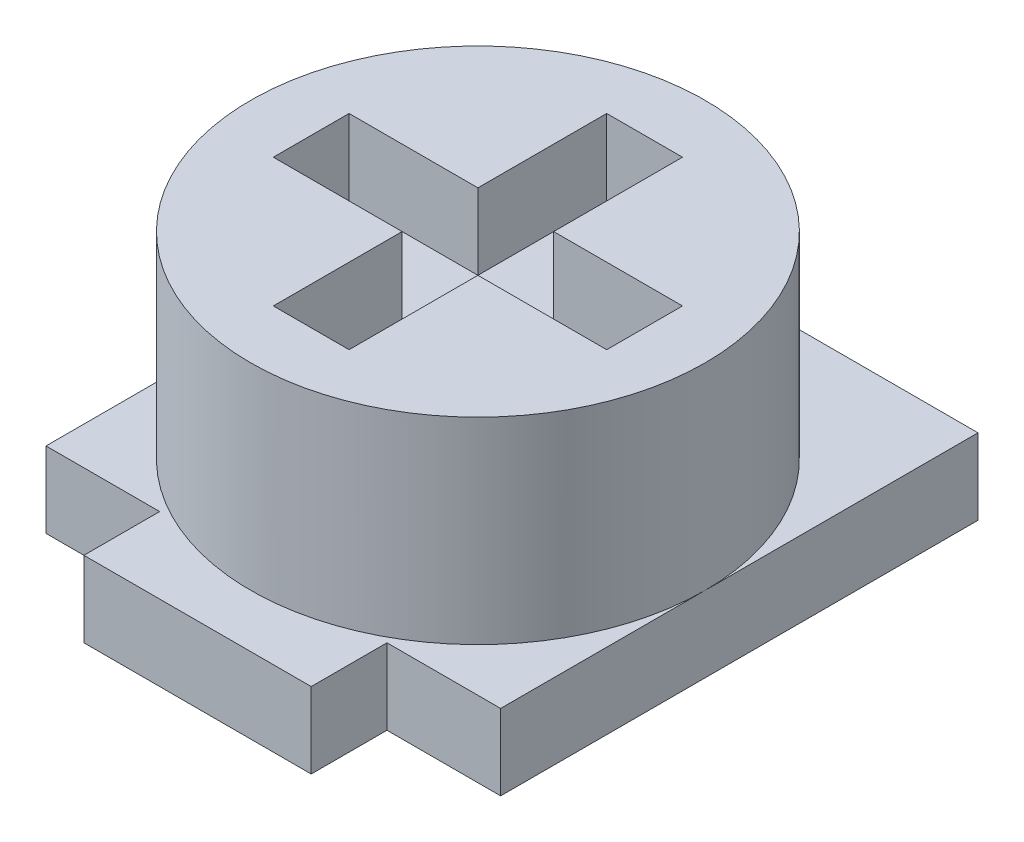
ISO-10303-21;
HEADER;
FILE_DESCRIPTION(('STEP AP214'),'2;1');
FILE_NAME('part.step','',(''),(''),'','','');
FILE_SCHEMA(('AUTOMOTIVE_DESIGN { 1 0 10303 214 1 1 1 1 }'));
ENDSEC;
DATA;
#1=APPLICATION_CONTEXT('core data for automotive mechanical design processes');
#2=APPLICATION_PROTOCOL_DEFINITION('international standard','automotive_design',2000,#1);
#3=PRODUCT_CONTEXT('',#1,'mechanical');
#4=PRODUCT('Part','Part','',(#3));
#5=PRODUCT_RELATED_PRODUCT_CATEGORY('part','',(#4));
#6=PRODUCT_DEFINITION_FORMATION('','',#4);
#7=PRODUCT_DEFINITION_CONTEXT('part definition',#1,'design');
#8=PRODUCT_DEFINITION('design','',#6,#7);
#9=PRODUCT_DEFINITION_SHAPE('','',#8);
#10=(LENGTH_UNIT() NAMED_UNIT(*) SI_UNIT(.MILLI.,.METRE.));
#11=(NAMED_UNIT(*) PLANE_ANGLE_UNIT() SI_UNIT($,.RADIAN.));
#12=(NAMED_UNIT(*) SI_UNIT($,.STERADIAN.) SOLID_ANGLE_UNIT());
#13=UNCERTAINTY_MEASURE_WITH_UNIT(LENGTH_MEASURE(1.E-05),#10,'distance_accuracy_value','');
#14=(GEOMETRIC_REPRESENTATION_CONTEXT(3) GLOBAL_UNCERTAINTY_ASSIGNED_CONTEXT((#13)) GLOBAL_UNIT_ASSIGNED_CONTEXT((#10,
#11,#12)) REPRESENTATION_CONTEXT('',''));
#15=CARTESIAN_POINT('',(0.,0.,0.));
#16=DIRECTION('',(0.,0.,1.));
#17=DIRECTION('',(1.,0.,0.));
#18=AXIS2_PLACEMENT_3D('',#15,#16,#17);
#19=CARTESIAN_POINT('',(0.,1.8,0.));
#20=DIRECTION('',(0.,1.,0.));
#21=DIRECTION('',(0.,0.,1.));
#22=AXIS2_PLACEMENT_3D('',#19,#20,#21);
#23=PLANE('',#22);
#24=CARTESIAN_POINT('',(0.,1.8,0.));
#25=DIRECTION('',(0.,1.,0.));
#26=DIRECTION('',(0.,0.,1.));
#27=AXIS2_PLACEMENT_3D('',#24,#25,#26);
#28=CIRCLE('',#27,1.5);
#29=CARTESIAN_POINT('',(0.,1.8,1.5));
#30=VERTEX_POINT('',#29);
#31=EDGE_CURVE('E326',#30,#30,#28,.T.);
#32=ORIENTED_EDGE('',*,*,#31,.T.);
#33=EDGE_LOOP('',(#32));
#34=FACE_BOUND('',#33,.T.);
#35=DIRECTION('',(1.,0.,0.));
#36=VECTOR('',#35,1.);
#37=CARTESIAN_POINT('',(0.,1.8,-0.25));
#38=LINE('',#37,#36);
#39=CARTESIAN_POINT('',(0.25,1.8,-0.25));
#40=VERTEX_POINT('',#39);
#41=CARTESIAN_POINT('',(1.1,1.8,-0.25));
#42=VERTEX_POINT('',#41);
#43=EDGE_CURVE('E227',#40,#42,#38,.T.);
#44=ORIENTED_EDGE('',*,*,#43,.T.);
#45=DIRECTION('',(0.,0.,1.));
#46=VECTOR('',#45,1.);
#47=CARTESIAN_POINT('',(1.1,1.8,0.));
#48=LINE('',#47,#46);
#49=CARTESIAN_POINT('',(1.1,1.8,0.25));
#50=VERTEX_POINT('',#49);
#51=EDGE_CURVE('E48',#42,#50,#48,.T.);
#52=ORIENTED_EDGE('',*,*,#51,.T.);
#53=DIRECTION('',(1.,0.,0.));
#54=VECTOR('',#53,1.);
#55=CARTESIAN_POINT('',(0.,1.8,0.25));
#56=LINE('',#55,#54);
#57=CARTESIAN_POINT('',(0.25,1.8,0.25));
#58=VERTEX_POINT('',#57);
#59=EDGE_CURVE('E197',#58,#50,#56,.T.);
#60=ORIENTED_EDGE('',*,*,#59,.F.);
#61=DIRECTION('',(0.,0.,1.));
#62=VECTOR('',#61,1.);
#63=CARTESIAN_POINT('',(0.25,1.8,0.));
#64=LINE('',#63,#62);
#65=CARTESIAN_POINT('',(0.25,1.8,1.1));
#66=VERTEX_POINT('',#65);
#67=EDGE_CURVE('E200',#58,#66,#64,.T.);
#68=ORIENTED_EDGE('',*,*,#67,.T.);
#69=DIRECTION('',(-1.,0.,0.));
#70=VECTOR('',#69,1.);
#71=CARTESIAN_POINT('',(0.,1.8,1.1));
#72=LINE('',#71,#70);
#73=CARTESIAN_POINT('',(-0.25,1.8,1.1));
#74=VERTEX_POINT('',#73);
#75=EDGE_CURVE('E250',#66,#74,#72,.T.);
#76=ORIENTED_EDGE('',*,*,#75,.T.);
#77=DIRECTION('',(0.,0.,1.));
#78=VECTOR('',#77,1.);
#79=CARTESIAN_POINT('',(-0.25,1.8,0.));
#80=LINE('',#79,#78);
#81=CARTESIAN_POINT('',(-0.25,1.8,0.25));
#82=VERTEX_POINT('',#81);
#83=EDGE_CURVE('E247',#82,#74,#80,.T.);
#84=ORIENTED_EDGE('',*,*,#83,.F.);
#85=DIRECTION('',(1.,0.,0.));
#86=VECTOR('',#85,1.);
#87=CARTESIAN_POINT('',(0.,1.8,0.25));
#88=LINE('',#87,#86);
#89=CARTESIAN_POINT('',(-1.1,1.8,0.25));
#90=VERTEX_POINT('',#89);
#91=EDGE_CURVE('E244',#90,#82,#88,.T.);
#92=ORIENTED_EDGE('',*,*,#91,.F.);
#93=DIRECTION('',(0.,0.,1.));
#94=VECTOR('',#93,1.);
#95=CARTESIAN_POINT('',(-1.1,1.8,0.));
#96=LINE('',#95,#94);
#97=CARTESIAN_POINT('',(-1.1,1.8,-0.25));
#98=VERTEX_POINT('',#97);
#99=EDGE_CURVE('E241',#98,#90,#96,.T.);
#100=ORIENTED_EDGE('',*,*,#99,.F.);
#101=DIRECTION('',(1.,0.,0.));
#102=VECTOR('',#101,1.);
#103=CARTESIAN_POINT('',(0.,1.8,-0.25));
#104=LINE('',#103,#102);
#105=CARTESIAN_POINT('',(-0.25,1.8,-0.25));
#106=VERTEX_POINT('',#105);
#107=EDGE_CURVE('E238',#98,#106,#104,.T.);
#108=ORIENTED_EDGE('',*,*,#107,.T.);
#109=DIRECTION('',(0.,0.,1.));
#110=VECTOR('',#109,1.);
#111=CARTESIAN_POINT('',(-0.25,1.8,0.));
#112=LINE('',#111,#110);
#113=CARTESIAN_POINT('',(-0.25,1.8,-1.1));
#114=VERTEX_POINT('',#113);
#115=EDGE_CURVE('E235',#114,#106,#112,.T.);
#116=ORIENTED_EDGE('',*,*,#115,.F.);
#117=DIRECTION('',(-1.,0.,0.));
#118=VECTOR('',#117,1.);
#119=CARTESIAN_POINT('',(0.,1.8,-1.1));
#120=LINE('',#119,#118);
#121=CARTESIAN_POINT('',(0.25,1.8,-1.1));
#122=VERTEX_POINT('',#121);
#123=EDGE_CURVE('E232',#122,#114,#120,.T.);
#124=ORIENTED_EDGE('',*,*,#123,.F.);
#125=DIRECTION('',(0.,0.,1.));
#126=VECTOR('',#125,1.);
#127=CARTESIAN_POINT('',(0.25,1.8,0.));
#128=LINE('',#127,#126);
#129=EDGE_CURVE('E229',#122,#40,#128,.T.);
#130=ORIENTED_EDGE('',*,*,#129,.T.);
#131=EDGE_LOOP('',(#44,#52,#60,#68,#76,#84,#92,#100,#108,#116,#124,#130));
#132=FACE_BOUND('',#131,.T.);
#133=ADVANCED_FACE('F33',(#34,#132),#23,.T.);
#134=CARTESIAN_POINT('',(0.,1.8,0.));
#135=DIRECTION('',(0.,-1.,0.));
#136=DIRECTION('',(0.,0.,-1.));
#137=AXIS2_PLACEMENT_3D('',#134,#135,#136);
#138=CYLINDRICAL_SURFACE('',#137,1.5);
#139=CARTESIAN_POINT('',(0.,0.5,0.));
#140=DIRECTION('',(0.,1.,0.));
#141=DIRECTION('',(0.,0.,1.));
#142=AXIS2_PLACEMENT_3D('',#139,#140,#141);
#143=CIRCLE('',#142,1.5);
#144=CARTESIAN_POINT('',(-1.5,0.5,0.));
#145=VERTEX_POINT('',#144);
#146=CARTESIAN_POINT('',(1.5,0.5,0.));
#147=VERTEX_POINT('',#146);
#148=EDGE_CURVE('E37',#145,#147,#143,.T.);
#149=ORIENTED_EDGE('',*,*,#148,.T.);
#150=EDGE_CURVE('E11',#147,#145,#143,.T.);
#151=ORIENTED_EDGE('',*,*,#150,.T.);
#152=EDGE_LOOP('',(#149,#151));
#153=FACE_BOUND('',#152,.T.);
#154=ORIENTED_EDGE('',*,*,#31,.F.);
#155=EDGE_LOOP('',(#154));
#156=FACE_BOUND('',#155,.T.);
#157=ADVANCED_FACE('F35',(#153,#156),#138,.T.);
#158=CARTESIAN_POINT('',(0.,0.5,0.));
#159=DIRECTION('',(0.,1.,0.));
#160=DIRECTION('',(0.,0.,1.));
#161=AXIS2_PLACEMENT_3D('',#158,#159,#160);
#162=PLANE('',#161);
#163=ORIENTED_EDGE('',*,*,#150,.F.);
#164=DIRECTION('',(0.,0.,1.));
#165=VECTOR('',#164,1.);
#166=CARTESIAN_POINT('',(1.5,0.5,1.35));
#167=LINE('',#166,#165);
#168=CARTESIAN_POINT('',(1.5,0.5,-1.8));
#169=VERTEX_POINT('',#168);
#170=EDGE_CURVE('E56',#169,#147,#167,.T.);
#171=ORIENTED_EDGE('',*,*,#170,.F.);
#172=DIRECTION('',(1.,0.,0.));
#173=VECTOR('',#172,1.);
#174=CARTESIAN_POINT('',(1.5,0.5,-1.8));
#175=LINE('',#174,#173);
#176=CARTESIAN_POINT('',(-1.5,0.5,-1.8));
#177=VERTEX_POINT('',#176);
#178=EDGE_CURVE('E297',#177,#169,#175,.T.);
#179=ORIENTED_EDGE('',*,*,#178,.F.);
#180=DIRECTION('',(0.,0.,-1.));
#181=VECTOR('',#180,1.);
#182=CARTESIAN_POINT('',(-1.5,0.5,-1.8));
#183=LINE('',#182,#181);
#184=EDGE_CURVE('E293',#145,#177,#183,.T.);
#185=ORIENTED_EDGE('',*,*,#184,.F.);
#186=EDGE_LOOP('',(#163,#171,#179,#185));
#187=FACE_BOUND('',#186,.T.);
#188=ADVANCED_FACE('F356',(#187),#162,.T.);
#189=CARTESIAN_POINT('',(1.5,0.5,1.35));
#190=DIRECTION('',(1.,0.,0.));
#191=DIRECTION('',(0.,0.,-1.));
#192=AXIS2_PLACEMENT_3D('',#189,#190,#191);
#193=PLANE('',#192);
#194=DIRECTION('',(0.,-1.,0.));
#195=VECTOR('',#194,1.);
#196=CARTESIAN_POINT('',(1.5,0.5,1.35));
#197=LINE('',#196,#195);
#198=CARTESIAN_POINT('',(1.5,0.5,1.35));
#199=VERTEX_POINT('',#198);
#200=CARTESIAN_POINT('',(1.5,0.,1.35));
#201=VERTEX_POINT('',#200);
#202=EDGE_CURVE('E323',#199,#201,#197,.T.);
#203=ORIENTED_EDGE('',*,*,#202,.T.);
#204=DIRECTION('',(0.,0.,1.));
#205=VECTOR('',#204,1.);
#206=CARTESIAN_POINT('',(1.5,0.,1.35));
#207=LINE('',#206,#205);
#208=CARTESIAN_POINT('',(1.5,0.,-1.8));
#209=VERTEX_POINT('',#208);
#210=EDGE_CURVE('E281',#209,#201,#207,.T.);
#211=ORIENTED_EDGE('',*,*,#210,.F.);
#212=DIRECTION('',(0.,-1.,0.));
#213=VECTOR('',#212,1.);
#214=CARTESIAN_POINT('',(1.5,0.5,-1.8));
#215=LINE('',#214,#213);
#216=EDGE_CURVE('E327',#169,#209,#215,.T.);
#217=ORIENTED_EDGE('',*,*,#216,.F.);
#218=ORIENTED_EDGE('',*,*,#170,.T.);
#219=EDGE_CURVE('E300',#147,#199,#167,.T.);
#220=ORIENTED_EDGE('',*,*,#219,.T.);
#221=EDGE_LOOP('',(#203,#211,#217,#218,#220));
#222=FACE_BOUND('',#221,.T.);
#223=ADVANCED_FACE('F382',(#222),#193,.T.);
#224=CARTESIAN_POINT('',(-1.5,0.5,-1.8));
#225=DIRECTION('',(-1.,0.,0.));
#226=DIRECTION('',(0.,0.,1.));
#227=AXIS2_PLACEMENT_3D('',#224,#225,#226);
#228=PLANE('',#227);
#229=DIRECTION('',(0.,0.,-1.));
#230=VECTOR('',#229,1.);
#231=CARTESIAN_POINT('',(-1.5,0.,-1.8));
#232=LINE('',#231,#230);
#233=CARTESIAN_POINT('',(-1.5,0.,1.35));
#234=VERTEX_POINT('',#233);
#235=CARTESIAN_POINT('',(-1.5,0.,-1.8));
#236=VERTEX_POINT('',#235);
#237=EDGE_CURVE('E317',#234,#236,#232,.T.);
#238=ORIENTED_EDGE('',*,*,#237,.F.);
#239=DIRECTION('',(0.,-1.,0.));
#240=VECTOR('',#239,1.);
#241=CARTESIAN_POINT('',(-1.5,0.5,1.35));
#242=LINE('',#241,#240);
#243=CARTESIAN_POINT('',(-1.5,0.5,1.35));
#244=VERTEX_POINT('',#243);
#245=EDGE_CURVE('E332',#244,#234,#242,.T.);
#246=ORIENTED_EDGE('',*,*,#245,.F.);
#247=EDGE_CURVE('E294',#244,#145,#183,.T.);
#248=ORIENTED_EDGE('',*,*,#247,.T.);
#249=ORIENTED_EDGE('',*,*,#184,.T.);
#250=DIRECTION('',(0.,-1.,0.));
#251=VECTOR('',#250,1.);
#252=CARTESIAN_POINT('',(-1.5,0.5,-1.8));
#253=LINE('',#252,#251);
#254=EDGE_CURVE('E329',#177,#236,#253,.T.);
#255=ORIENTED_EDGE('',*,*,#254,.T.);
#256=EDGE_LOOP('',(#238,#246,#248,#249,#255));
#257=FACE_BOUND('',#256,.T.);
#258=ADVANCED_FACE('F359',(#257),#228,.T.);
#259=CARTESIAN_POINT('',(0.75,0.5,1.35));
#260=DIRECTION('',(0.,0.,1.));
#261=DIRECTION('',(1.,0.,0.));
#262=AXIS2_PLACEMENT_3D('',#259,#260,#261);
#263=PLANE('',#262);
#264=DIRECTION('',(-1.,0.,0.));
#265=VECTOR('',#264,1.);
#266=CARTESIAN_POINT('',(0.75,0.,1.35));
#267=LINE('',#266,#265);
#268=CARTESIAN_POINT('',(0.75,0.,1.35));
#269=VERTEX_POINT('',#268);
#270=EDGE_CURVE('E257',#201,#269,#267,.T.);
#271=ORIENTED_EDGE('',*,*,#270,.F.);
#272=ORIENTED_EDGE('',*,*,#202,.F.);
#273=DIRECTION('',(-1.,0.,0.));
#274=VECTOR('',#273,1.);
#275=CARTESIAN_POINT('',(0.75,0.5,1.35));
#276=LINE('',#275,#274);
#277=CARTESIAN_POINT('',(0.75,0.5,1.35));
#278=VERTEX_POINT('',#277);
#279=EDGE_CURVE('E277',#199,#278,#276,.T.);
#280=ORIENTED_EDGE('',*,*,#279,.T.);
#281=DIRECTION('',(0.,-1.,0.));
#282=VECTOR('',#281,1.);
#283=CARTESIAN_POINT('',(0.75,0.5,1.35));
#284=LINE('',#283,#282);
#285=EDGE_CURVE('E302',#278,#269,#284,.T.);
#286=ORIENTED_EDGE('',*,*,#285,.T.);
#287=EDGE_LOOP('',(#271,#272,#280,#286));
#288=FACE_BOUND('',#287,.T.);
#289=ADVANCED_FACE('F380',(#288),#263,.T.);
#290=CARTESIAN_POINT('',(1.5,0.5,-1.8));
#291=DIRECTION('',(0.,0.,-1.));
#292=DIRECTION('',(-1.,0.,0.));
#293=AXIS2_PLACEMENT_3D('',#290,#291,#292);
#294=PLANE('',#293);
#295=DIRECTION('',(1.,0.,0.));
#296=VECTOR('',#295,1.);
#297=CARTESIAN_POINT('',(1.5,0.,-1.8));
#298=LINE('',#297,#296);
#299=EDGE_CURVE('E319',#236,#209,#298,.T.);
#300=ORIENTED_EDGE('',*,*,#299,.F.);
#301=ORIENTED_EDGE('',*,*,#254,.F.);
#302=ORIENTED_EDGE('',*,*,#178,.T.);
#303=ORIENTED_EDGE('',*,*,#216,.T.);
#304=EDGE_LOOP('',(#300,#301,#302,#303));
#305=FACE_BOUND('',#304,.T.);
#306=ADVANCED_FACE('F385',(#305),#294,.T.);
#307=CARTESIAN_POINT('',(-1.5,0.5,1.35));
#308=DIRECTION('',(0.,0.,1.));
#309=DIRECTION('',(1.,0.,0.));
#310=AXIS2_PLACEMENT_3D('',#307,#308,#309);
#311=PLANE('',#310);
#312=DIRECTION('',(-1.,0.,0.));
#313=VECTOR('',#312,1.);
#314=CARTESIAN_POINT('',(-1.5,0.,1.35));
#315=LINE('',#314,#313);
#316=CARTESIAN_POINT('',(-0.75,0.,1.35));
#317=VERTEX_POINT('',#316);
#318=EDGE_CURVE('E314',#317,#234,#315,.T.);
#319=ORIENTED_EDGE('',*,*,#318,.F.);
#320=DIRECTION('',(0.,-1.,0.));
#321=VECTOR('',#320,1.);
#322=CARTESIAN_POINT('',(-0.75,0.5,1.35));
#323=LINE('',#322,#321);
#324=CARTESIAN_POINT('',(-0.75,0.5,1.35));
#325=VERTEX_POINT('',#324);
#326=EDGE_CURVE('E335',#325,#317,#323,.T.);
#327=ORIENTED_EDGE('',*,*,#326,.F.);
#328=DIRECTION('',(-1.,0.,0.));
#329=VECTOR('',#328,1.);
#330=CARTESIAN_POINT('',(-1.5,0.5,1.35));
#331=LINE('',#330,#329);
#332=EDGE_CURVE('E290',#325,#244,#331,.T.);
#333=ORIENTED_EDGE('',*,*,#332,.T.);
#334=ORIENTED_EDGE('',*,*,#245,.T.);
#335=EDGE_LOOP('',(#319,#327,#333,#334));
#336=FACE_BOUND('',#335,.T.);
#337=ADVANCED_FACE('F362',(#336),#311,.T.);
#338=CARTESIAN_POINT('',(-0.75,0.5,1.35));
#339=DIRECTION('',(-1.,0.,0.));
#340=DIRECTION('',(0.,0.,1.));
#341=AXIS2_PLACEMENT_3D('',#338,#339,#340);
#342=PLANE('',#341);
#343=DIRECTION('',(0.,0.,-1.));
#344=VECTOR('',#343,1.);
#345=CARTESIAN_POINT('',(-0.75,0.,1.35));
#346=LINE('',#345,#344);
#347=CARTESIAN_POINT('',(-0.75,0.,1.85));
#348=VERTEX_POINT('',#347);
#349=EDGE_CURVE('E311',#348,#317,#346,.T.);
#350=ORIENTED_EDGE('',*,*,#349,.F.);
#351=DIRECTION('',(0.,-1.,0.));
#352=VECTOR('',#351,1.);
#353=CARTESIAN_POINT('',(-0.75,0.5,1.85));
#354=LINE('',#353,#352);
#355=CARTESIAN_POINT('',(-0.75,0.5,1.85));
#356=VERTEX_POINT('',#355);
#357=EDGE_CURVE('E337',#356,#348,#354,.T.);
#358=ORIENTED_EDGE('',*,*,#357,.F.);
#359=DIRECTION('',(0.,0.,-1.));
#360=VECTOR('',#359,1.);
#361=CARTESIAN_POINT('',(-0.75,0.5,1.35));
#362=LINE('',#361,#360);
#363=EDGE_CURVE('E287',#356,#325,#362,.T.);
#364=ORIENTED_EDGE('',*,*,#363,.T.);
#365=ORIENTED_EDGE('',*,*,#326,.T.);
#366=EDGE_LOOP('',(#350,#358,#364,#365));
#367=FACE_BOUND('',#366,.T.);
#368=ADVANCED_FACE('F368',(#367),#342,.T.);
#369=CARTESIAN_POINT('',(-0.75,0.5,1.85));
#370=DIRECTION('',(0.,0.,1.));
#371=DIRECTION('',(1.,0.,0.));
#372=AXIS2_PLACEMENT_3D('',#369,#370,#371);
#373=PLANE('',#372);
#374=DIRECTION('',(-1.,0.,0.));
#375=VECTOR('',#374,1.);
#376=CARTESIAN_POINT('',(-0.75,0.,1.85));
#377=LINE('',#376,#375);
#378=CARTESIAN_POINT('',(0.75,0.,1.85));
#379=VERTEX_POINT('',#378);
#380=EDGE_CURVE('E308',#379,#348,#377,.T.);
#381=ORIENTED_EDGE('',*,*,#380,.F.);
#382=DIRECTION('',(0.,-1.,0.));
#383=VECTOR('',#382,1.);
#384=CARTESIAN_POINT('',(0.75,0.5,1.85));
#385=LINE('',#384,#383);
#386=CARTESIAN_POINT('',(0.75,0.5,1.85));
#387=VERTEX_POINT('',#386);
#388=EDGE_CURVE('E339',#387,#379,#385,.T.);
#389=ORIENTED_EDGE('',*,*,#388,.F.);
#390=DIRECTION('',(-1.,0.,0.));
#391=VECTOR('',#390,1.);
#392=CARTESIAN_POINT('',(-0.75,0.5,1.85));
#393=LINE('',#392,#391);
#394=EDGE_CURVE('E284',#387,#356,#393,.T.);
#395=ORIENTED_EDGE('',*,*,#394,.T.);
#396=ORIENTED_EDGE('',*,*,#357,.T.);
#397=EDGE_LOOP('',(#381,#389,#395,#396));
#398=FACE_BOUND('',#397,.T.);
#399=ADVANCED_FACE('F373',(#398),#373,.T.);
#400=CARTESIAN_POINT('',(0.75,0.5,1.85));
#401=DIRECTION('',(1.,0.,0.));
#402=DIRECTION('',(0.,0.,-1.));
#403=AXIS2_PLACEMENT_3D('',#400,#401,#402);
#404=PLANE('',#403);
#405=DIRECTION('',(0.,0.,1.));
#406=VECTOR('',#405,1.);
#407=CARTESIAN_POINT('',(0.75,0.,1.85));
#408=LINE('',#407,#406);
#409=EDGE_CURVE('E305',#269,#379,#408,.T.);
#410=ORIENTED_EDGE('',*,*,#409,.F.);
#411=ORIENTED_EDGE('',*,*,#285,.F.);
#412=DIRECTION('',(0.,0.,1.));
#413=VECTOR('',#412,1.);
#414=CARTESIAN_POINT('',(0.75,0.5,1.85));
#415=LINE('',#414,#413);
#416=EDGE_CURVE('E280',#278,#387,#415,.T.);
#417=ORIENTED_EDGE('',*,*,#416,.T.);
#418=ORIENTED_EDGE('',*,*,#388,.T.);
#419=EDGE_LOOP('',(#410,#411,#417,#418));
#420=FACE_BOUND('',#419,.T.);
#421=ADVANCED_FACE('F376',(#420),#404,.T.);
#422=ORIENTED_EDGE('',*,*,#148,.F.);
#423=ORIENTED_EDGE('',*,*,#247,.F.);
#424=ORIENTED_EDGE('',*,*,#332,.F.);
#425=ORIENTED_EDGE('',*,*,#363,.F.);
#426=ORIENTED_EDGE('',*,*,#394,.F.);
#427=ORIENTED_EDGE('',*,*,#416,.F.);
#428=ORIENTED_EDGE('',*,*,#279,.F.);
#429=ORIENTED_EDGE('',*,*,#219,.F.);
#430=EDGE_LOOP('',(#422,#423,#424,#425,#426,#427,#428,#429));
#431=FACE_BOUND('',#430,.T.);
#432=ADVANCED_FACE('F351',(#431),#162,.T.);
#433=CARTESIAN_POINT('',(0.,0.,0.));
#434=DIRECTION('',(0.,1.,0.));
#435=DIRECTION('',(0.,0.,1.));
#436=AXIS2_PLACEMENT_3D('',#433,#434,#435);
#437=PLANE('',#436);
#438=ORIENTED_EDGE('',*,*,#318,.T.);
#439=ORIENTED_EDGE('',*,*,#237,.T.);
#440=ORIENTED_EDGE('',*,*,#299,.T.);
#441=ORIENTED_EDGE('',*,*,#210,.T.);
#442=ORIENTED_EDGE('',*,*,#270,.T.);
#443=ORIENTED_EDGE('',*,*,#409,.T.);
#444=ORIENTED_EDGE('',*,*,#380,.T.);
#445=ORIENTED_EDGE('',*,*,#349,.T.);
#446=EDGE_LOOP('',(#438,#439,#440,#441,#442,#443,#444,#445));
#447=FACE_BOUND('',#446,.T.);
#448=ADVANCED_FACE('F364',(#447),#437,.F.);
#449=CARTESIAN_POINT('',(1.1,1.3,0.));
#450=DIRECTION('',(-1.,0.,0.));
#451=DIRECTION('',(0.,0.,1.));
#452=AXIS2_PLACEMENT_3D('',#449,#450,#451);
#453=PLANE('',#452);
#454=ORIENTED_EDGE('',*,*,#51,.F.);
#455=DIRECTION('',(0.,1.,0.));
#456=VECTOR('',#455,1.);
#457=CARTESIAN_POINT('',(1.1,1.3,-0.25));
#458=LINE('',#457,#456);
#459=CARTESIAN_POINT('',(1.1,1.3,-0.25));
#460=VERTEX_POINT('',#459);
#461=EDGE_CURVE('E180',#460,#42,#458,.T.);
#462=ORIENTED_EDGE('',*,*,#461,.F.);
#463=DIRECTION('',(0.,0.,1.));
#464=VECTOR('',#463,1.);
#465=CARTESIAN_POINT('',(1.1,1.3,0.));
#466=LINE('',#465,#464);
#467=CARTESIAN_POINT('',(1.1,1.3,0.25));
#468=VERTEX_POINT('',#467);
#469=EDGE_CURVE('E187',#460,#468,#466,.T.);
#470=ORIENTED_EDGE('',*,*,#469,.T.);
#471=DIRECTION('',(0.,1.,0.));
#472=VECTOR('',#471,1.);
#473=CARTESIAN_POINT('',(1.1,1.3,0.25));
#474=LINE('',#473,#472);
#475=EDGE_CURVE('E255',#468,#50,#474,.T.);
#476=ORIENTED_EDGE('',*,*,#475,.T.);
#477=EDGE_LOOP('',(#454,#462,#470,#476));
#478=FACE_BOUND('',#477,.T.);
#479=ADVANCED_FACE('F189',(#478),#453,.T.);
#480=CARTESIAN_POINT('',(0.,1.3,0.25));
#481=DIRECTION('',(0.,0.,1.));
#482=DIRECTION('',(1.,0.,0.));
#483=AXIS2_PLACEMENT_3D('',#480,#481,#482);
#484=PLANE('',#483);
#485=ORIENTED_EDGE('',*,*,#59,.T.);
#486=ORIENTED_EDGE('',*,*,#475,.F.);
#487=DIRECTION('',(1.,0.,0.));
#488=VECTOR('',#487,1.);
#489=CARTESIAN_POINT('',(0.,1.3,0.25));
#490=LINE('',#489,#488);
#491=CARTESIAN_POINT('',(0.25,1.3,0.25));
#492=VERTEX_POINT('',#491);
#493=EDGE_CURVE('E191',#492,#468,#490,.T.);
#494=ORIENTED_EDGE('',*,*,#493,.F.);
#495=DIRECTION('',(0.,1.,0.));
#496=VECTOR('',#495,1.);
#497=CARTESIAN_POINT('',(0.25,1.3,0.25));
#498=LINE('',#497,#496);
#499=EDGE_CURVE('E258',#492,#58,#498,.T.);
#500=ORIENTED_EDGE('',*,*,#499,.T.);
#501=EDGE_LOOP('',(#485,#486,#494,#500));
#502=FACE_BOUND('',#501,.T.);
#503=ADVANCED_FACE('F408',(#502),#484,.F.);
#504=CARTESIAN_POINT('',(0.25,1.3,0.));
#505=DIRECTION('',(-1.,0.,0.));
#506=DIRECTION('',(0.,0.,1.));
#507=AXIS2_PLACEMENT_3D('',#504,#505,#506);
#508=PLANE('',#507);
#509=ORIENTED_EDGE('',*,*,#67,.F.);
#510=ORIENTED_EDGE('',*,*,#499,.F.);
#511=DIRECTION('',(0.,0.,1.));
#512=VECTOR('',#511,1.);
#513=CARTESIAN_POINT('',(0.25,1.3,0.));
#514=LINE('',#513,#512);
#515=CARTESIAN_POINT('',(0.25,1.3,1.1));
#516=VERTEX_POINT('',#515);
#517=EDGE_CURVE('E223',#492,#516,#514,.T.);
#518=ORIENTED_EDGE('',*,*,#517,.T.);
#519=DIRECTION('',(0.,1.,0.));
#520=VECTOR('',#519,1.);
#521=CARTESIAN_POINT('',(0.25,1.3,1.1));
#522=LINE('',#521,#520);
#523=EDGE_CURVE('E260',#516,#66,#522,.T.);
#524=ORIENTED_EDGE('',*,*,#523,.T.);
#525=EDGE_LOOP('',(#509,#510,#518,#524));
#526=FACE_BOUND('',#525,.T.);
#527=ADVANCED_FACE('F463',(#526),#508,.T.);
#528=CARTESIAN_POINT('',(0.,1.3,1.1));
#529=DIRECTION('',(0.,0.,-1.));
#530=DIRECTION('',(-1.,0.,0.));
#531=AXIS2_PLACEMENT_3D('',#528,#529,#530);
#532=PLANE('',#531);
#533=ORIENTED_EDGE('',*,*,#75,.F.);
#534=ORIENTED_EDGE('',*,*,#523,.F.);
#535=DIRECTION('',(-1.,0.,0.));
#536=VECTOR('',#535,1.);
#537=CARTESIAN_POINT('',(0.,1.3,1.1));
#538=LINE('',#537,#536);
#539=CARTESIAN_POINT('',(-0.25,1.3,1.1));
#540=VERTEX_POINT('',#539);
#541=EDGE_CURVE('E221',#516,#540,#538,.T.);
#542=ORIENTED_EDGE('',*,*,#541,.T.);
#543=DIRECTION('',(0.,1.,0.));
#544=VECTOR('',#543,1.);
#545=CARTESIAN_POINT('',(-0.25,1.3,1.1));
#546=LINE('',#545,#544);
#547=EDGE_CURVE('E262',#540,#74,#546,.T.);
#548=ORIENTED_EDGE('',*,*,#547,.T.);
#549=EDGE_LOOP('',(#533,#534,#542,#548));
#550=FACE_BOUND('',#549,.T.);
#551=ADVANCED_FACE('F473',(#550),#532,.T.);
#552=CARTESIAN_POINT('',(-0.25,1.3,0.));
#553=DIRECTION('',(-1.,0.,0.));
#554=DIRECTION('',(0.,0.,1.));
#555=AXIS2_PLACEMENT_3D('',#552,#553,#554);
#556=PLANE('',#555);
#557=ORIENTED_EDGE('',*,*,#83,.T.);
#558=ORIENTED_EDGE('',*,*,#547,.F.);
#559=DIRECTION('',(0.,0.,1.));
#560=VECTOR('',#559,1.);
#561=CARTESIAN_POINT('',(-0.25,1.3,0.));
#562=LINE('',#561,#560);
#563=CARTESIAN_POINT('',(-0.25,1.3,0.25));
#564=VERTEX_POINT('',#563);
#565=EDGE_CURVE('E218',#564,#540,#562,.T.);
#566=ORIENTED_EDGE('',*,*,#565,.F.);
#567=DIRECTION('',(0.,1.,0.));
#568=VECTOR('',#567,1.);
#569=CARTESIAN_POINT('',(-0.25,1.3,0.25));
#570=LINE('',#569,#568);
#571=EDGE_CURVE('E264',#564,#82,#570,.T.);
#572=ORIENTED_EDGE('',*,*,#571,.T.);
#573=EDGE_LOOP('',(#557,#558,#566,#572));
#574=FACE_BOUND('',#573,.T.);
#575=ADVANCED_FACE('F483',(#574),#556,.F.);
#576=CARTESIAN_POINT('',(0.,1.3,0.25));
#577=DIRECTION('',(0.,0.,1.));
#578=DIRECTION('',(1.,0.,0.));
#579=AXIS2_PLACEMENT_3D('',#576,#577,#578);
#580=PLANE('',#579);
#581=ORIENTED_EDGE('',*,*,#91,.T.);
#582=ORIENTED_EDGE('',*,*,#571,.F.);
#583=DIRECTION('',(1.,0.,0.));
#584=VECTOR('',#583,1.);
#585=CARTESIAN_POINT('',(0.,1.3,0.25));
#586=LINE('',#585,#584);
#587=CARTESIAN_POINT('',(-1.1,1.3,0.25));
#588=VERTEX_POINT('',#587);
#589=EDGE_CURVE('E215',#588,#564,#586,.T.);
#590=ORIENTED_EDGE('',*,*,#589,.F.);
#591=DIRECTION('',(0.,1.,0.));
#592=VECTOR('',#591,1.);
#593=CARTESIAN_POINT('',(-1.1,1.3,0.25));
#594=LINE('',#593,#592);
#595=EDGE_CURVE('E266',#588,#90,#594,.T.);
#596=ORIENTED_EDGE('',*,*,#595,.T.);
#597=EDGE_LOOP('',(#581,#582,#590,#596));
#598=FACE_BOUND('',#597,.T.);
#599=ADVANCED_FACE('F493',(#598),#580,.F.);
#600=CARTESIAN_POINT('',(-1.1,1.3,0.));
#601=DIRECTION('',(-1.,0.,0.));
#602=DIRECTION('',(0.,0.,1.));
#603=AXIS2_PLACEMENT_3D('',#600,#601,#602);
#604=PLANE('',#603);
#605=ORIENTED_EDGE('',*,*,#99,.T.);
#606=ORIENTED_EDGE('',*,*,#595,.F.);
#607=DIRECTION('',(0.,0.,1.));
#608=VECTOR('',#607,1.);
#609=CARTESIAN_POINT('',(-1.1,1.3,0.));
#610=LINE('',#609,#608);
#611=CARTESIAN_POINT('',(-1.1,1.3,-0.25));
#612=VERTEX_POINT('',#611);
#613=EDGE_CURVE('E212',#612,#588,#610,.T.);
#614=ORIENTED_EDGE('',*,*,#613,.F.);
#615=DIRECTION('',(0.,1.,0.));
#616=VECTOR('',#615,1.);
#617=CARTESIAN_POINT('',(-1.1,1.3,-0.25));
#618=LINE('',#617,#616);
#619=EDGE_CURVE('E268',#612,#98,#618,.T.);
#620=ORIENTED_EDGE('',*,*,#619,.T.);
#621=EDGE_LOOP('',(#605,#606,#614,#620));
#622=FACE_BOUND('',#621,.T.);
#623=ADVANCED_FACE('F503',(#622),#604,.F.);
#624=CARTESIAN_POINT('',(0.,1.3,-0.25));
#625=DIRECTION('',(0.,0.,1.));
#626=DIRECTION('',(1.,0.,0.));
#627=AXIS2_PLACEMENT_3D('',#624,#625,#626);
#628=PLANE('',#627);
#629=ORIENTED_EDGE('',*,*,#107,.F.);
#630=ORIENTED_EDGE('',*,*,#619,.F.);
#631=DIRECTION('',(1.,0.,0.));
#632=VECTOR('',#631,1.);
#633=CARTESIAN_POINT('',(0.,1.3,-0.25));
#634=LINE('',#633,#632);
#635=CARTESIAN_POINT('',(-0.25,1.3,-0.25));
#636=VERTEX_POINT('',#635);
#637=EDGE_CURVE('E210',#612,#636,#634,.T.);
#638=ORIENTED_EDGE('',*,*,#637,.T.);
#639=DIRECTION('',(0.,1.,0.));
#640=VECTOR('',#639,1.);
#641=CARTESIAN_POINT('',(-0.25,1.3,-0.25));
#642=LINE('',#641,#640);
#643=EDGE_CURVE('E270',#636,#106,#642,.T.);
#644=ORIENTED_EDGE('',*,*,#643,.T.);
#645=EDGE_LOOP('',(#629,#630,#638,#644));
#646=FACE_BOUND('',#645,.T.);
#647=ADVANCED_FACE('F513',(#646),#628,.T.);
#648=CARTESIAN_POINT('',(-0.25,1.3,0.));
#649=DIRECTION('',(-1.,0.,0.));
#650=DIRECTION('',(0.,0.,1.));
#651=AXIS2_PLACEMENT_3D('',#648,#649,#650);
#652=PLANE('',#651);
#653=ORIENTED_EDGE('',*,*,#115,.T.);
#654=ORIENTED_EDGE('',*,*,#643,.F.);
#655=DIRECTION('',(0.,0.,1.));
#656=VECTOR('',#655,1.);
#657=CARTESIAN_POINT('',(-0.25,1.3,0.));
#658=LINE('',#657,#656);
#659=CARTESIAN_POINT('',(-0.25,1.3,-1.1));
#660=VERTEX_POINT('',#659);
#661=EDGE_CURVE('E207',#660,#636,#658,.T.);
#662=ORIENTED_EDGE('',*,*,#661,.F.);
#663=DIRECTION('',(0.,1.,0.));
#664=VECTOR('',#663,1.);
#665=CARTESIAN_POINT('',(-0.25,1.3,-1.1));
#666=LINE('',#665,#664);
#667=EDGE_CURVE('E272',#660,#114,#666,.T.);
#668=ORIENTED_EDGE('',*,*,#667,.T.);
#669=EDGE_LOOP('',(#653,#654,#662,#668));
#670=FACE_BOUND('',#669,.T.);
#671=ADVANCED_FACE('F523',(#670),#652,.F.);
#672=CARTESIAN_POINT('',(0.,1.3,-1.1));
#673=DIRECTION('',(0.,0.,-1.));
#674=DIRECTION('',(-1.,0.,0.));
#675=AXIS2_PLACEMENT_3D('',#672,#673,#674);
#676=PLANE('',#675);
#677=ORIENTED_EDGE('',*,*,#123,.T.);
#678=ORIENTED_EDGE('',*,*,#667,.F.);
#679=DIRECTION('',(-1.,0.,0.));
#680=VECTOR('',#679,1.);
#681=CARTESIAN_POINT('',(0.,1.3,-1.1));
#682=LINE('',#681,#680);
#683=CARTESIAN_POINT('',(0.25,1.3,-1.1));
#684=VERTEX_POINT('',#683);
#685=EDGE_CURVE('E204',#684,#660,#682,.T.);
#686=ORIENTED_EDGE('',*,*,#685,.F.);
#687=DIRECTION('',(0.,1.,0.));
#688=VECTOR('',#687,1.);
#689=CARTESIAN_POINT('',(0.25,1.3,-1.1));
#690=LINE('',#689,#688);
#691=EDGE_CURVE('E274',#684,#122,#690,.T.);
#692=ORIENTED_EDGE('',*,*,#691,.T.);
#693=EDGE_LOOP('',(#677,#678,#686,#692));
#694=FACE_BOUND('',#693,.T.);
#695=ADVANCED_FACE('F533',(#694),#676,.F.);
#696=CARTESIAN_POINT('',(0.25,1.3,0.));
#697=DIRECTION('',(-1.,0.,0.));
#698=DIRECTION('',(0.,0.,1.));
#699=AXIS2_PLACEMENT_3D('',#696,#697,#698);
#700=PLANE('',#699);
#701=ORIENTED_EDGE('',*,*,#129,.F.);
#702=ORIENTED_EDGE('',*,*,#691,.F.);
#703=DIRECTION('',(0.,0.,1.));
#704=VECTOR('',#703,1.);
#705=CARTESIAN_POINT('',(0.25,1.3,0.));
#706=LINE('',#705,#704);
#707=CARTESIAN_POINT('',(0.25,1.3,-0.25));
#708=VERTEX_POINT('',#707);
#709=EDGE_CURVE('E186',#684,#708,#706,.T.);
#710=ORIENTED_EDGE('',*,*,#709,.T.);
#711=DIRECTION('',(0.,1.,0.));
#712=VECTOR('',#711,1.);
#713=CARTESIAN_POINT('',(0.25,1.3,-0.25));
#714=LINE('',#713,#712);
#715=EDGE_CURVE('E182',#708,#40,#714,.T.);
#716=ORIENTED_EDGE('',*,*,#715,.T.);
#717=EDGE_LOOP('',(#701,#702,#710,#716));
#718=FACE_BOUND('',#717,.T.);
#719=ADVANCED_FACE('F543',(#718),#700,.T.);
#720=CARTESIAN_POINT('',(0.,1.3,-0.25));
#721=DIRECTION('',(0.,0.,1.));
#722=DIRECTION('',(1.,0.,0.));
#723=AXIS2_PLACEMENT_3D('',#720,#721,#722);
#724=PLANE('',#723);
#725=ORIENTED_EDGE('',*,*,#43,.F.);
#726=ORIENTED_EDGE('',*,*,#715,.F.);
#727=DIRECTION('',(1.,0.,0.));
#728=VECTOR('',#727,1.);
#729=CARTESIAN_POINT('',(0.,1.3,-0.25));
#730=LINE('',#729,#728);
#731=EDGE_CURVE('E177',#708,#460,#730,.T.);
#732=ORIENTED_EDGE('',*,*,#731,.T.);
#733=ORIENTED_EDGE('',*,*,#461,.T.);
#734=EDGE_LOOP('',(#725,#726,#732,#733));
#735=FACE_BOUND('',#734,.T.);
#736=ADVANCED_FACE('F179',(#735),#724,.T.);
#737=CARTESIAN_POINT('',(0.,1.3,0.));
#738=DIRECTION('',(0.,1.,0.));
#739=DIRECTION('',(0.,0.,1.));
#740=AXIS2_PLACEMENT_3D('',#737,#738,#739);
#741=PLANE('',#740);
#742=ORIENTED_EDGE('',*,*,#469,.F.);
#743=ORIENTED_EDGE('',*,*,#731,.F.);
#744=ORIENTED_EDGE('',*,*,#709,.F.);
#745=ORIENTED_EDGE('',*,*,#685,.T.);
#746=ORIENTED_EDGE('',*,*,#661,.T.);
#747=ORIENTED_EDGE('',*,*,#637,.F.);
#748=ORIENTED_EDGE('',*,*,#613,.T.);
#749=ORIENTED_EDGE('',*,*,#589,.T.);
#750=ORIENTED_EDGE('',*,*,#565,.T.);
#751=ORIENTED_EDGE('',*,*,#541,.F.);
#752=ORIENTED_EDGE('',*,*,#517,.F.);
#753=ORIENTED_EDGE('',*,*,#493,.T.);
#754=EDGE_LOOP('',(#742,#743,#744,#745,#746,#747,#748,#749,#750,#751,#752,#753));
#755=FACE_BOUND('',#754,.T.);
#756=ADVANCED_FACE('F194',(#755),#741,.T.);
#757=CLOSED_SHELL('',(#133,#157,#188,#223,#258,#289,#306,#337,#368,#399,#421,#432,#448,#479,
#503,#527,#551,#575,#599,#623,#647,#671,#695,#719,#736,#756));
#758=MANIFOLD_SOLID_BREP('B2',#757);
#759=ADVANCED_BREP_SHAPE_REPRESENTATION('',(#18,#758),#14);
#760=SHAPE_DEFINITION_REPRESENTATION(#9,#759);
ENDSEC;
END-ISO-10303-21;
